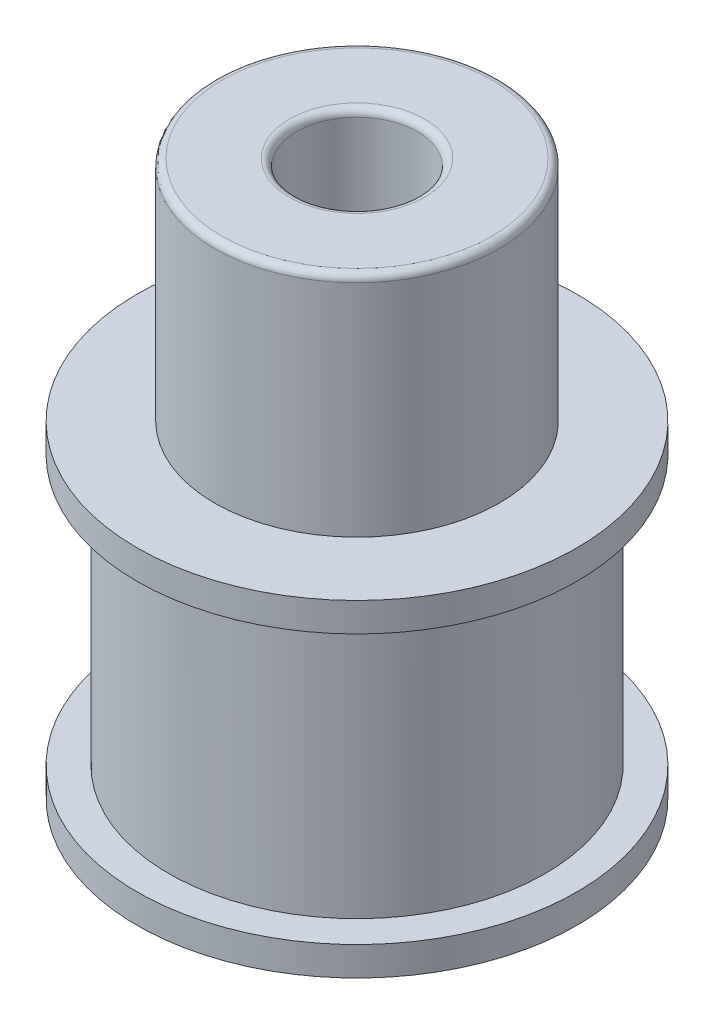
ISO-10303-21;
HEADER;
FILE_DESCRIPTION(('STEP AP214'),'2;1');
FILE_NAME('part.step','',(''),(''),'','','');
FILE_SCHEMA(('AUTOMOTIVE_DESIGN { 1 0 10303 214 1 1 1 1 }'));
ENDSEC;
DATA;
#1=APPLICATION_CONTEXT('core data for automotive mechanical design processes');
#2=APPLICATION_PROTOCOL_DEFINITION('international standard','automotive_design',2000,#1);
#3=PRODUCT_CONTEXT('',#1,'mechanical');
#4=PRODUCT('Part','Part','',(#3));
#5=PRODUCT_RELATED_PRODUCT_CATEGORY('part','',(#4));
#6=PRODUCT_DEFINITION_FORMATION('','',#4);
#7=PRODUCT_DEFINITION_CONTEXT('part definition',#1,'design');
#8=PRODUCT_DEFINITION('design','',#6,#7);
#9=PRODUCT_DEFINITION_SHAPE('','',#8);
#10=(LENGTH_UNIT() NAMED_UNIT(*) SI_UNIT(.MILLI.,.METRE.));
#11=(NAMED_UNIT(*) PLANE_ANGLE_UNIT() SI_UNIT($,.RADIAN.));
#12=(NAMED_UNIT(*) SI_UNIT($,.STERADIAN.) SOLID_ANGLE_UNIT());
#13=UNCERTAINTY_MEASURE_WITH_UNIT(LENGTH_MEASURE(1.E-05),#10,'distance_accuracy_value','');
#14=(GEOMETRIC_REPRESENTATION_CONTEXT(3) GLOBAL_UNCERTAINTY_ASSIGNED_CONTEXT((#13)) GLOBAL_UNIT_ASSIGNED_CONTEXT((#10,
#11,#12)) REPRESENTATION_CONTEXT('',''));
#15=CARTESIAN_POINT('',(0.,0.,0.));
#16=DIRECTION('',(0.,0.,1.));
#17=DIRECTION('',(1.,0.,0.));
#18=AXIS2_PLACEMENT_3D('',#15,#16,#17);
#19=CARTESIAN_POINT('',(0.,39.4875065895823,0.));
#20=DIRECTION('',(0.,-1.,0.));
#21=DIRECTION('',(0.,0.,-1.));
#22=AXIS2_PLACEMENT_3D('',#19,#20,#21);
#23=CYLINDRICAL_SURFACE('',#22,7.78);
#24=CARTESIAN_POINT('',(0.,12.32,0.));
#25=DIRECTION('',(0.,1.,0.));
#26=DIRECTION('',(0.,0.,1.));
#27=AXIS2_PLACEMENT_3D('',#24,#25,#26);
#28=CIRCLE('',#27,7.78);
#29=CARTESIAN_POINT('',(0.,12.32,7.78));
#30=VERTEX_POINT('',#29);
#31=EDGE_CURVE('E63',#30,#30,#28,.F.);
#32=ORIENTED_EDGE('',*,*,#31,.T.);
#33=EDGE_LOOP('',(#32));
#34=FACE_BOUND('',#33,.T.);
#35=CARTESIAN_POINT('',(0.,1.2,0.));
#36=DIRECTION('',(0.,-1.,0.));
#37=DIRECTION('',(0.,0.,-1.));
#38=AXIS2_PLACEMENT_3D('',#35,#36,#37);
#39=CIRCLE('',#38,7.78);
#40=CARTESIAN_POINT('',(0.,1.2,-7.78));
#41=VERTEX_POINT('',#40);
#42=EDGE_CURVE('E60',#41,#41,#39,.F.);
#43=ORIENTED_EDGE('',*,*,#42,.T.);
#44=EDGE_LOOP('',(#43));
#45=FACE_BOUND('',#44,.T.);
#46=ADVANCED_FACE('F33',(#34,#45),#23,.T.);
#47=CARTESIAN_POINT('',(0.,13.52,0.));
#48=DIRECTION('',(0.,-1.,0.));
#49=DIRECTION('',(0.,0.,-1.));
#50=AXIS2_PLACEMENT_3D('',#47,#48,#49);
#51=CYLINDRICAL_SURFACE('',#50,9.09);
#52=CARTESIAN_POINT('',(0.,12.32,0.));
#53=DIRECTION('',(0.,1.,0.));
#54=DIRECTION('',(0.,0.,1.));
#55=AXIS2_PLACEMENT_3D('',#52,#53,#54);
#56=CIRCLE('',#55,9.09);
#57=CARTESIAN_POINT('',(0.,12.32,9.09));
#58=VERTEX_POINT('',#57);
#59=EDGE_CURVE('E65',#58,#58,#56,.T.);
#60=ORIENTED_EDGE('',*,*,#59,.T.);
#61=EDGE_LOOP('',(#60));
#62=FACE_BOUND('',#61,.T.);
#63=CARTESIAN_POINT('',(0.,13.52,0.));
#64=DIRECTION('',(0.,1.,0.));
#65=DIRECTION('',(0.,0.,1.));
#66=AXIS2_PLACEMENT_3D('',#63,#64,#65);
#67=CIRCLE('',#66,9.09);
#68=CARTESIAN_POINT('',(0.,13.52,9.09));
#69=VERTEX_POINT('',#68);
#70=EDGE_CURVE('E68',#69,#69,#67,.T.);
#71=ORIENTED_EDGE('',*,*,#70,.F.);
#72=EDGE_LOOP('',(#71));
#73=FACE_BOUND('',#72,.T.);
#74=ADVANCED_FACE('F101',(#62,#73),#51,.T.);
#75=CARTESIAN_POINT('',(0.,13.52,0.));
#76=DIRECTION('',(0.,1.,0.));
#77=DIRECTION('',(0.,0.,1.));
#78=AXIS2_PLACEMENT_3D('',#75,#76,#77);
#79=PLANE('',#78);
#80=CARTESIAN_POINT('',(0.,13.52,0.));
#81=DIRECTION('',(0.,1.,0.));
#82=DIRECTION('',(0.,0.,1.));
#83=AXIS2_PLACEMENT_3D('',#80,#81,#82);
#84=CIRCLE('',#83,5.885);
#85=CARTESIAN_POINT('',(0.,13.52,5.885));
#86=VERTEX_POINT('',#85);
#87=EDGE_CURVE('E59',#86,#86,#84,.T.);
#88=ORIENTED_EDGE('',*,*,#87,.F.);
#89=EDGE_LOOP('',(#88));
#90=FACE_BOUND('',#89,.T.);
#91=ORIENTED_EDGE('',*,*,#70,.T.);
#92=EDGE_LOOP('',(#91));
#93=FACE_BOUND('',#92,.T.);
#94=ADVANCED_FACE('F107',(#90,#93),#79,.T.);
#95=CARTESIAN_POINT('',(0.,22.93,0.));
#96=DIRECTION('',(0.,-1.,0.));
#97=DIRECTION('',(0.,0.,-1.));
#98=AXIS2_PLACEMENT_3D('',#95,#96,#97);
#99=CYLINDRICAL_SURFACE('',#98,5.885);
#100=CARTESIAN_POINT('',(0.,22.63,0.));
#101=DIRECTION('',(0.,1.,0.));
#102=DIRECTION('',(0.,0.,1.));
#103=AXIS2_PLACEMENT_3D('',#100,#101,#102);
#104=CIRCLE('',#103,5.885);
#105=CARTESIAN_POINT('',(0.,22.63,5.885));
#106=VERTEX_POINT('',#105);
#107=EDGE_CURVE('E12',#106,#106,#104,.F.);
#108=ORIENTED_EDGE('',*,*,#107,.T.);
#109=EDGE_LOOP('',(#108));
#110=FACE_BOUND('',#109,.T.);
#111=ORIENTED_EDGE('',*,*,#87,.T.);
#112=EDGE_LOOP('',(#111));
#113=FACE_BOUND('',#112,.T.);
#114=ADVANCED_FACE('F118',(#110,#113),#99,.T.);
#115=CARTESIAN_POINT('',(0.,22.93,0.));
#116=DIRECTION('',(0.,1.,0.));
#117=DIRECTION('',(0.,0.,1.));
#118=AXIS2_PLACEMENT_3D('',#115,#116,#117);
#119=PLANE('',#118);
#120=CARTESIAN_POINT('',(0.,22.93,0.));
#121=DIRECTION('',(0.,1.,0.));
#122=DIRECTION('',(0.,0.,1.));
#123=AXIS2_PLACEMENT_3D('',#120,#121,#122);
#124=CIRCLE('',#123,2.8);
#125=CARTESIAN_POINT('',(0.,22.93,2.8));
#126=VERTEX_POINT('',#125);
#127=EDGE_CURVE('E40',#126,#126,#124,.F.);
#128=ORIENTED_EDGE('',*,*,#127,.T.);
#129=EDGE_LOOP('',(#128));
#130=FACE_BOUND('',#129,.T.);
#131=CARTESIAN_POINT('',(0.,22.93,0.));
#132=DIRECTION('',(0.,1.,0.));
#133=DIRECTION('',(0.,0.,1.));
#134=AXIS2_PLACEMENT_3D('',#131,#132,#133);
#135=CIRCLE('',#134,5.585);
#136=CARTESIAN_POINT('',(0.,22.93,5.585));
#137=VERTEX_POINT('',#136);
#138=EDGE_CURVE('E44',#137,#137,#135,.T.);
#139=ORIENTED_EDGE('',*,*,#138,.T.);
#140=EDGE_LOOP('',(#139));
#141=FACE_BOUND('',#140,.T.);
#142=ADVANCED_FACE('F114',(#130,#141),#119,.T.);
#143=CARTESIAN_POINT('',(0.,12.32,0.));
#144=DIRECTION('',(0.,1.,0.));
#145=DIRECTION('',(0.,0.,1.));
#146=AXIS2_PLACEMENT_3D('',#143,#144,#145);
#147=PLANE('',#146);
#148=ORIENTED_EDGE('',*,*,#31,.F.);
#149=EDGE_LOOP('',(#148));
#150=FACE_BOUND('',#149,.T.);
#151=ORIENTED_EDGE('',*,*,#59,.F.);
#152=EDGE_LOOP('',(#151));
#153=FACE_BOUND('',#152,.T.);
#154=ADVANCED_FACE('F96',(#150,#153),#147,.F.);
#155=CARTESIAN_POINT('',(0.,1.2,0.));
#156=DIRECTION('',(0.,-1.,0.));
#157=DIRECTION('',(0.,0.,-1.));
#158=AXIS2_PLACEMENT_3D('',#155,#156,#157);
#159=CYLINDRICAL_SURFACE('',#158,9.09);
#160=CARTESIAN_POINT('',(0.,1.2,0.));
#161=DIRECTION('',(0.,-1.,0.));
#162=DIRECTION('',(0.,0.,-1.));
#163=AXIS2_PLACEMENT_3D('',#160,#161,#162);
#164=CIRCLE('',#163,9.09);
#165=CARTESIAN_POINT('',(0.,1.2,-9.09));
#166=VERTEX_POINT('',#165);
#167=EDGE_CURVE('E64',#166,#166,#164,.T.);
#168=ORIENTED_EDGE('',*,*,#167,.T.);
#169=EDGE_LOOP('',(#168));
#170=FACE_BOUND('',#169,.T.);
#171=CARTESIAN_POINT('',(0.,0.,0.));
#172=DIRECTION('',(0.,-1.,0.));
#173=DIRECTION('',(0.,0.,-1.));
#174=AXIS2_PLACEMENT_3D('',#171,#172,#173);
#175=CIRCLE('',#174,9.09);
#176=CARTESIAN_POINT('',(0.,0.,-9.09));
#177=VERTEX_POINT('',#176);
#178=EDGE_CURVE('E75',#177,#177,#175,.T.);
#179=ORIENTED_EDGE('',*,*,#178,.F.);
#180=EDGE_LOOP('',(#179));
#181=FACE_BOUND('',#180,.T.);
#182=ADVANCED_FACE('F81',(#170,#181),#159,.T.);
#183=CARTESIAN_POINT('',(0.,1.2,0.));
#184=DIRECTION('',(0.,-1.,0.));
#185=DIRECTION('',(0.,0.,-1.));
#186=AXIS2_PLACEMENT_3D('',#183,#184,#185);
#187=PLANE('',#186);
#188=ORIENTED_EDGE('',*,*,#42,.F.);
#189=EDGE_LOOP('',(#188));
#190=FACE_BOUND('',#189,.T.);
#191=ORIENTED_EDGE('',*,*,#167,.F.);
#192=EDGE_LOOP('',(#191));
#193=FACE_BOUND('',#192,.T.);
#194=ADVANCED_FACE('F84',(#190,#193),#187,.F.);
#195=CARTESIAN_POINT('',(0.,0.,0.));
#196=DIRECTION('',(0.,1.,0.));
#197=DIRECTION('',(0.,0.,1.));
#198=AXIS2_PLACEMENT_3D('',#195,#196,#197);
#199=PLANE('',#198);
#200=CARTESIAN_POINT('',(0.,0.,0.));
#201=DIRECTION('',(0.,1.,0.));
#202=DIRECTION('',(0.,0.,1.));
#203=AXIS2_PLACEMENT_3D('',#200,#201,#202);
#204=CIRCLE('',#203,2.8);
#205=CARTESIAN_POINT('',(0.,0.,2.8));
#206=VERTEX_POINT('',#205);
#207=EDGE_CURVE('E48',#206,#206,#204,.T.);
#208=ORIENTED_EDGE('',*,*,#207,.T.);
#209=EDGE_LOOP('',(#208));
#210=FACE_BOUND('',#209,.T.);
#211=ORIENTED_EDGE('',*,*,#178,.T.);
#212=EDGE_LOOP('',(#211));
#213=FACE_BOUND('',#212,.T.);
#214=ADVANCED_FACE('F86',(#210,#213),#199,.F.);
#215=CARTESIAN_POINT('',(0.,22.93,0.));
#216=DIRECTION('',(0.,-1.,0.));
#217=DIRECTION('',(0.,0.,-1.));
#218=AXIS2_PLACEMENT_3D('',#215,#216,#217);
#219=CYLINDRICAL_SURFACE('',#218,2.5);
#220=CARTESIAN_POINT('',(0.,0.300000000000002,0.));
#221=DIRECTION('',(0.,1.,0.));
#222=DIRECTION('',(0.,0.,1.));
#223=AXIS2_PLACEMENT_3D('',#220,#221,#222);
#224=CIRCLE('',#223,2.5);
#225=CARTESIAN_POINT('',(0.,0.300000000000002,2.5));
#226=VERTEX_POINT('',#225);
#227=EDGE_CURVE('E53',#226,#226,#224,.F.);
#228=ORIENTED_EDGE('',*,*,#227,.T.);
#229=EDGE_LOOP('',(#228));
#230=FACE_BOUND('',#229,.T.);
#231=CARTESIAN_POINT('',(0.,22.63,0.));
#232=DIRECTION('',(0.,1.,0.));
#233=DIRECTION('',(0.,0.,1.));
#234=AXIS2_PLACEMENT_3D('',#231,#232,#233);
#235=CIRCLE('',#234,2.5);
#236=CARTESIAN_POINT('',(0.,22.63,2.5));
#237=VERTEX_POINT('',#236);
#238=EDGE_CURVE('E56',#237,#237,#235,.T.);
#239=ORIENTED_EDGE('',*,*,#238,.T.);
#240=EDGE_LOOP('',(#239));
#241=FACE_BOUND('',#240,.T.);
#242=ADVANCED_FACE('F93',(#230,#241),#219,.F.);
#243=CARTESIAN_POINT('',(0.,0.300000000000002,0.));
#244=DIRECTION('',(0.,1.,0.));
#245=DIRECTION('',(0.,0.,1.));
#246=AXIS2_PLACEMENT_3D('',#243,#244,#245);
#247=TOROIDAL_SURFACE('',#246,2.8,0.3);
#248=ORIENTED_EDGE('',*,*,#207,.F.);
#249=EDGE_LOOP('',(#248));
#250=FACE_BOUND('',#249,.T.);
#251=ORIENTED_EDGE('',*,*,#227,.F.);
#252=EDGE_LOOP('',(#251));
#253=FACE_BOUND('',#252,.T.);
#254=ADVANCED_FACE('F124',(#250,#253),#247,.T.);
#255=CARTESIAN_POINT('',(0.,22.63,0.));
#256=DIRECTION('',(0.,1.,0.));
#257=DIRECTION('',(0.,0.,1.));
#258=AXIS2_PLACEMENT_3D('',#255,#256,#257);
#259=TOROIDAL_SURFACE('',#258,2.8,0.3);
#260=ORIENTED_EDGE('',*,*,#238,.F.);
#261=EDGE_LOOP('',(#260));
#262=FACE_BOUND('',#261,.T.);
#263=ORIENTED_EDGE('',*,*,#127,.F.);
#264=EDGE_LOOP('',(#263));
#265=FACE_BOUND('',#264,.T.);
#266=ADVANCED_FACE('F126',(#262,#265),#259,.T.);
#267=CARTESIAN_POINT('',(0.,22.63,0.));
#268=DIRECTION('',(0.,1.,0.));
#269=DIRECTION('',(0.,0.,1.));
#270=AXIS2_PLACEMENT_3D('',#267,#268,#269);
#271=TOROIDAL_SURFACE('',#270,5.585,0.3);
#272=ORIENTED_EDGE('',*,*,#107,.F.);
#273=EDGE_LOOP('',(#272));
#274=FACE_BOUND('',#273,.T.);
#275=ORIENTED_EDGE('',*,*,#138,.F.);
#276=EDGE_LOOP('',(#275));
#277=FACE_BOUND('',#276,.T.);
#278=ADVANCED_FACE('F35',(#274,#277),#271,.T.);
#279=CLOSED_SHELL('',(#46,#74,#94,#114,#142,#154,#182,#194,#214,#242,#254,#266,#278));
#280=MANIFOLD_SOLID_BREP('B2',#279);
#281=ADVANCED_BREP_SHAPE_REPRESENTATION('',(#18,#280),#14);
#282=SHAPE_DEFINITION_REPRESENTATION(#9,#281);
ENDSEC;
END-ISO-10303-21;
